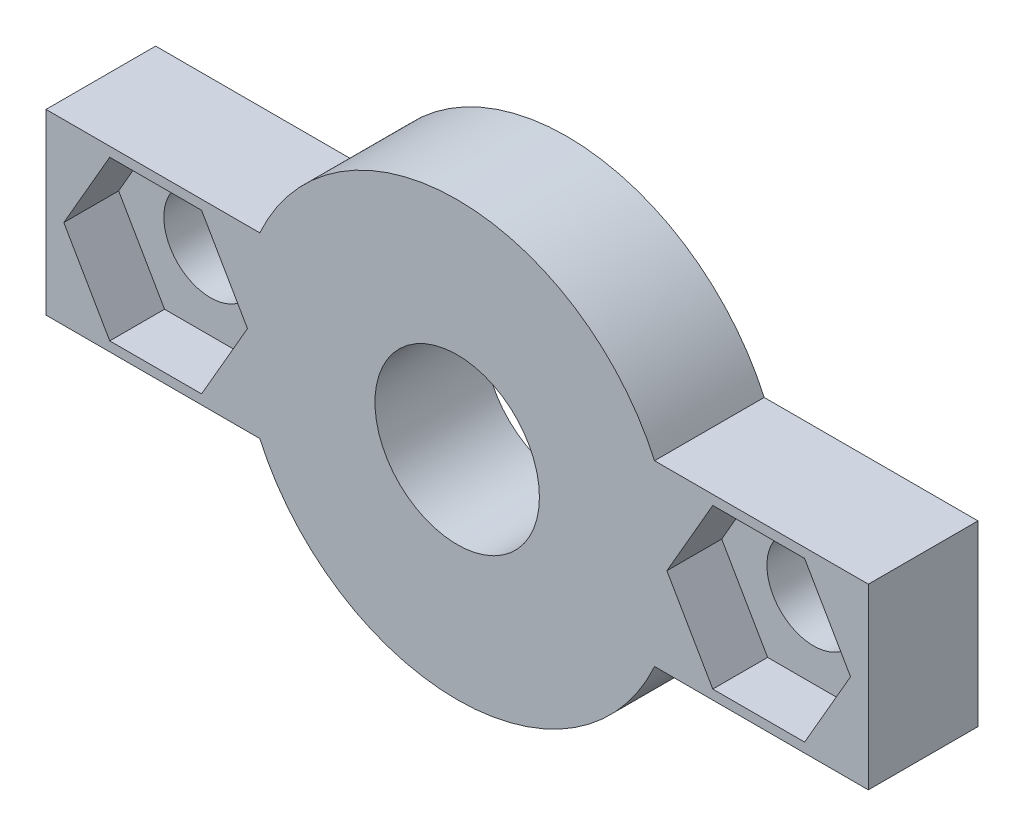
ISO-10303-21;
HEADER;
FILE_DESCRIPTION(('STEP AP214'),'2;1');
FILE_NAME('part.step','',(''),(''),'','','');
FILE_SCHEMA(('AUTOMOTIVE_DESIGN { 1 0 10303 214 1 1 1 1 }'));
ENDSEC;
DATA;
#1=APPLICATION_CONTEXT('core data for automotive mechanical design processes');
#2=APPLICATION_PROTOCOL_DEFINITION('international standard','automotive_design',2000,#1);
#3=PRODUCT_CONTEXT('',#1,'mechanical');
#4=PRODUCT('Part','Part','',(#3));
#5=PRODUCT_RELATED_PRODUCT_CATEGORY('part','',(#4));
#6=PRODUCT_DEFINITION_FORMATION('','',#4);
#7=PRODUCT_DEFINITION_CONTEXT('part definition',#1,'design');
#8=PRODUCT_DEFINITION('design','',#6,#7);
#9=PRODUCT_DEFINITION_SHAPE('','',#8);
#10=(LENGTH_UNIT() NAMED_UNIT(*) SI_UNIT(.MILLI.,.METRE.));
#11=(NAMED_UNIT(*) PLANE_ANGLE_UNIT() SI_UNIT($,.RADIAN.));
#12=(NAMED_UNIT(*) SI_UNIT($,.STERADIAN.) SOLID_ANGLE_UNIT());
#13=UNCERTAINTY_MEASURE_WITH_UNIT(LENGTH_MEASURE(1.E-05),#10,'distance_accuracy_value','');
#14=(GEOMETRIC_REPRESENTATION_CONTEXT(3) GLOBAL_UNCERTAINTY_ASSIGNED_CONTEXT((#13)) GLOBAL_UNIT_ASSIGNED_CONTEXT((#10,
#11,#12)) REPRESENTATION_CONTEXT('',''));
#15=CARTESIAN_POINT('',(0.,0.,0.));
#16=DIRECTION('',(0.,0.,1.));
#17=DIRECTION('',(1.,0.,0.));
#18=AXIS2_PLACEMENT_3D('',#15,#16,#17);
#19=CARTESIAN_POINT('',(0.,0.,4.));
#20=DIRECTION('',(0.,0.,1.));
#21=DIRECTION('',(1.,0.,0.));
#22=AXIS2_PLACEMENT_3D('',#19,#20,#21);
#23=PLANE('',#22);
#24=DIRECTION('',(-0.5,-0.866025403784439,0.));
#25=VECTOR('',#24,1.);
#26=CARTESIAN_POINT('',(-12.675,2.90118510267787,4.));
#27=LINE('',#26,#25);
#28=CARTESIAN_POINT('',(-12.675,2.90118510267787,4.));
#29=VERTEX_POINT('',#28);
#30=CARTESIAN_POINT('',(-14.35,0.,4.));
#31=VERTEX_POINT('',#30);
#32=EDGE_CURVE('E57',#29,#31,#27,.T.);
#33=ORIENTED_EDGE('',*,*,#32,.F.);
#34=DIRECTION('',(-1.,0.,0.));
#35=VECTOR('',#34,1.);
#36=CARTESIAN_POINT('',(-9.325,2.90118510267787,4.));
#37=LINE('',#36,#35);
#38=CARTESIAN_POINT('',(-9.325,2.90118510267787,4.));
#39=VERTEX_POINT('',#38);
#40=EDGE_CURVE('E203',#39,#29,#37,.T.);
#41=ORIENTED_EDGE('',*,*,#40,.F.);
#42=DIRECTION('',(-0.5,0.866025403784439,0.));
#43=VECTOR('',#42,1.);
#44=CARTESIAN_POINT('',(-7.65,0.,4.));
#45=LINE('',#44,#43);
#46=CARTESIAN_POINT('',(-7.65,0.,4.));
#47=VERTEX_POINT('',#46);
#48=EDGE_CURVE('E207',#47,#39,#45,.T.);
#49=ORIENTED_EDGE('',*,*,#48,.F.);
#50=DIRECTION('',(0.5,0.866025403784439,0.));
#51=VECTOR('',#50,1.);
#52=CARTESIAN_POINT('',(-9.325,-2.90118510267787,4.));
#53=LINE('',#52,#51);
#54=CARTESIAN_POINT('',(-9.325,-2.90118510267787,4.));
#55=VERTEX_POINT('',#54);
#56=EDGE_CURVE('E234',#55,#47,#53,.T.);
#57=ORIENTED_EDGE('',*,*,#56,.F.);
#58=DIRECTION('',(1.,0.,0.));
#59=VECTOR('',#58,1.);
#60=CARTESIAN_POINT('',(-12.675,-2.90118510267787,4.));
#61=LINE('',#60,#59);
#62=CARTESIAN_POINT('',(-12.675,-2.90118510267787,4.));
#63=VERTEX_POINT('',#62);
#64=EDGE_CURVE('E230',#63,#55,#61,.T.);
#65=ORIENTED_EDGE('',*,*,#64,.F.);
#66=DIRECTION('',(0.5,-0.866025403784438,0.));
#67=VECTOR('',#66,1.);
#68=CARTESIAN_POINT('',(-14.35,0.,4.));
#69=LINE('',#68,#67);
#70=EDGE_CURVE('E226',#31,#63,#69,.T.);
#71=ORIENTED_EDGE('',*,*,#70,.F.);
#72=EDGE_LOOP('',(#33,#41,#49,#57,#65,#71));
#73=FACE_BOUND('',#72,.T.);
#74=DIRECTION('',(0.5,0.866025403784439,0.));
#75=VECTOR('',#74,1.);
#76=CARTESIAN_POINT('',(12.675,-2.90118510267787,4.));
#77=LINE('',#76,#75);
#78=CARTESIAN_POINT('',(12.675,-2.90118510267787,4.));
#79=VERTEX_POINT('',#78);
#80=CARTESIAN_POINT('',(14.35,0.,4.));
#81=VERTEX_POINT('',#80);
#82=EDGE_CURVE('E65',#79,#81,#77,.T.);
#83=ORIENTED_EDGE('',*,*,#82,.F.);
#84=DIRECTION('',(1.,0.,0.));
#85=VECTOR('',#84,1.);
#86=CARTESIAN_POINT('',(9.325,-2.90118510267787,4.));
#87=LINE('',#86,#85);
#88=CARTESIAN_POINT('',(9.325,-2.90118510267787,4.));
#89=VERTEX_POINT('',#88);
#90=EDGE_CURVE('E261',#89,#79,#87,.T.);
#91=ORIENTED_EDGE('',*,*,#90,.F.);
#92=DIRECTION('',(0.5,-0.866025403784439,0.));
#93=VECTOR('',#92,1.);
#94=CARTESIAN_POINT('',(7.65,0.,4.));
#95=LINE('',#94,#93);
#96=CARTESIAN_POINT('',(7.65,0.,4.));
#97=VERTEX_POINT('',#96);
#98=EDGE_CURVE('E296',#97,#89,#95,.T.);
#99=ORIENTED_EDGE('',*,*,#98,.F.);
#100=DIRECTION('',(-0.5,-0.866025403784439,0.));
#101=VECTOR('',#100,1.);
#102=CARTESIAN_POINT('',(9.325,2.90118510267787,4.));
#103=LINE('',#102,#101);
#104=CARTESIAN_POINT('',(9.325,2.90118510267787,4.));
#105=VERTEX_POINT('',#104);
#106=EDGE_CURVE('E292',#105,#97,#103,.T.);
#107=ORIENTED_EDGE('',*,*,#106,.F.);
#108=DIRECTION('',(-1.,0.,0.));
#109=VECTOR('',#108,1.);
#110=CARTESIAN_POINT('',(12.675,2.90118510267787,4.));
#111=LINE('',#110,#109);
#112=CARTESIAN_POINT('',(12.675,2.90118510267787,4.));
#113=VERTEX_POINT('',#112);
#114=EDGE_CURVE('E288',#113,#105,#111,.T.);
#115=ORIENTED_EDGE('',*,*,#114,.F.);
#116=DIRECTION('',(-0.5,0.866025403784439,0.));
#117=VECTOR('',#116,1.);
#118=CARTESIAN_POINT('',(14.35,0.,4.));
#119=LINE('',#118,#117);
#120=EDGE_CURVE('E284',#81,#113,#119,.T.);
#121=ORIENTED_EDGE('',*,*,#120,.F.);
#122=EDGE_LOOP('',(#83,#91,#99,#107,#115,#121));
#123=FACE_BOUND('',#122,.T.);
#124=DIRECTION('',(0.,-1.,0.));
#125=VECTOR('',#124,1.);
#126=CARTESIAN_POINT('',(-15.,-3.25,4.));
#127=LINE('',#126,#125);
#128=CARTESIAN_POINT('',(-15.,3.25,4.));
#129=VERTEX_POINT('',#128);
#130=CARTESIAN_POINT('',(-15.,-3.25,4.));
#131=VERTEX_POINT('',#130);
#132=EDGE_CURVE('E327',#129,#131,#127,.T.);
#133=ORIENTED_EDGE('',*,*,#132,.T.);
#134=DIRECTION('',(1.,0.,0.));
#135=VECTOR('',#134,1.);
#136=CARTESIAN_POINT('',(-7.20052081449669,-3.25,4.));
#137=LINE('',#136,#135);
#138=CARTESIAN_POINT('',(-7.20052081449669,-3.25,4.));
#139=VERTEX_POINT('',#138);
#140=EDGE_CURVE('E331',#131,#139,#137,.T.);
#141=ORIENTED_EDGE('',*,*,#140,.T.);
#142=CARTESIAN_POINT('',(0.,0.,4.));
#143=DIRECTION('',(0.,0.,1.));
#144=DIRECTION('',(1.,0.,0.));
#145=AXIS2_PLACEMENT_3D('',#142,#143,#144);
#146=CIRCLE('',#145,7.9);
#147=CARTESIAN_POINT('',(7.20052081449669,-3.25,4.));
#148=VERTEX_POINT('',#147);
#149=EDGE_CURVE('E335',#139,#148,#146,.T.);
#150=ORIENTED_EDGE('',*,*,#149,.T.);
#151=DIRECTION('',(1.,0.,0.));
#152=VECTOR('',#151,1.);
#153=CARTESIAN_POINT('',(15.,-3.25,4.));
#154=LINE('',#153,#152);
#155=CARTESIAN_POINT('',(15.,-3.25,4.));
#156=VERTEX_POINT('',#155);
#157=EDGE_CURVE('E338',#148,#156,#154,.T.);
#158=ORIENTED_EDGE('',*,*,#157,.T.);
#159=DIRECTION('',(0.,1.,0.));
#160=VECTOR('',#159,1.);
#161=CARTESIAN_POINT('',(15.,-3.25,4.));
#162=LINE('',#161,#160);
#163=CARTESIAN_POINT('',(15.,3.25,4.));
#164=VERTEX_POINT('',#163);
#165=EDGE_CURVE('E341',#156,#164,#162,.T.);
#166=ORIENTED_EDGE('',*,*,#165,.T.);
#167=DIRECTION('',(-1.,0.,0.));
#168=VECTOR('',#167,1.);
#169=CARTESIAN_POINT('',(15.,3.25,4.));
#170=LINE('',#169,#168);
#171=CARTESIAN_POINT('',(7.20052081449669,3.25,4.));
#172=VERTEX_POINT('',#171);
#173=EDGE_CURVE('E344',#164,#172,#170,.T.);
#174=ORIENTED_EDGE('',*,*,#173,.T.);
#175=CARTESIAN_POINT('',(0.,0.,4.));
#176=DIRECTION('',(0.,0.,1.));
#177=DIRECTION('',(1.,0.,0.));
#178=AXIS2_PLACEMENT_3D('',#175,#176,#177);
#179=CIRCLE('',#178,7.9);
#180=CARTESIAN_POINT('',(-7.20052081449669,3.25,4.));
#181=VERTEX_POINT('',#180);
#182=EDGE_CURVE('E347',#172,#181,#179,.T.);
#183=ORIENTED_EDGE('',*,*,#182,.T.);
#184=DIRECTION('',(-1.,0.,0.));
#185=VECTOR('',#184,1.);
#186=CARTESIAN_POINT('',(-7.20052081449669,3.25,4.));
#187=LINE('',#186,#185);
#188=EDGE_CURVE('E350',#181,#129,#187,.T.);
#189=ORIENTED_EDGE('',*,*,#188,.T.);
#190=EDGE_LOOP('',(#133,#141,#150,#158,#166,#174,#183,#189));
#191=FACE_BOUND('',#190,.T.);
#192=CARTESIAN_POINT('',(0.,0.,4.));
#193=DIRECTION('',(0.,0.,1.));
#194=DIRECTION('',(1.,0.,0.));
#195=AXIS2_PLACEMENT_3D('',#192,#193,#194);
#196=CIRCLE('',#195,3.);
#197=CARTESIAN_POINT('',(3.,0.,4.));
#198=VERTEX_POINT('',#197);
#199=EDGE_CURVE('E319',#198,#198,#196,.T.);
#200=ORIENTED_EDGE('',*,*,#199,.F.);
#201=EDGE_LOOP('',(#200));
#202=FACE_BOUND('',#201,.T.);
#203=ADVANCED_FACE('F39',(#73,#123,#191,#202),#23,.T.);
#204=CARTESIAN_POINT('',(0.,0.,0.));
#205=DIRECTION('',(0.,0.,1.));
#206=DIRECTION('',(1.,0.,0.));
#207=AXIS2_PLACEMENT_3D('',#204,#205,#206);
#208=PLANE('',#207);
#209=CARTESIAN_POINT('',(-11.,0.,0.));
#210=DIRECTION('',(0.,0.,1.));
#211=DIRECTION('',(1.,0.,0.));
#212=AXIS2_PLACEMENT_3D('',#209,#210,#211);
#213=CIRCLE('',#212,1.7);
#214=CARTESIAN_POINT('',(-9.3,0.,0.));
#215=VERTEX_POINT('',#214);
#216=EDGE_CURVE('E405',#215,#215,#213,.T.);
#217=ORIENTED_EDGE('',*,*,#216,.T.);
#218=EDGE_LOOP('',(#217));
#219=FACE_BOUND('',#218,.T.);
#220=CARTESIAN_POINT('',(11.,0.,0.));
#221=DIRECTION('',(0.,0.,1.));
#222=DIRECTION('',(1.,0.,0.));
#223=AXIS2_PLACEMENT_3D('',#220,#221,#222);
#224=CIRCLE('',#223,1.7);
#225=CARTESIAN_POINT('',(12.7,0.,0.));
#226=VERTEX_POINT('',#225);
#227=EDGE_CURVE('E210',#226,#226,#224,.T.);
#228=ORIENTED_EDGE('',*,*,#227,.T.);
#229=EDGE_LOOP('',(#228));
#230=FACE_BOUND('',#229,.T.);
#231=DIRECTION('',(0.,-1.,0.));
#232=VECTOR('',#231,1.);
#233=CARTESIAN_POINT('',(-15.,-3.25,0.));
#234=LINE('',#233,#232);
#235=CARTESIAN_POINT('',(-15.,3.25,0.));
#236=VERTEX_POINT('',#235);
#237=CARTESIAN_POINT('',(-15.,-3.25,0.));
#238=VERTEX_POINT('',#237);
#239=EDGE_CURVE('E323',#236,#238,#234,.T.);
#240=ORIENTED_EDGE('',*,*,#239,.F.);
#241=DIRECTION('',(-1.,0.,0.));
#242=VECTOR('',#241,1.);
#243=CARTESIAN_POINT('',(-7.20052081449669,3.25,0.));
#244=LINE('',#243,#242);
#245=CARTESIAN_POINT('',(-7.20052081449669,3.25,0.));
#246=VERTEX_POINT('',#245);
#247=EDGE_CURVE('E332',#246,#236,#244,.T.);
#248=ORIENTED_EDGE('',*,*,#247,.F.);
#249=CARTESIAN_POINT('',(0.,0.,0.));
#250=DIRECTION('',(0.,0.,1.));
#251=DIRECTION('',(1.,0.,0.));
#252=AXIS2_PLACEMENT_3D('',#249,#250,#251);
#253=CIRCLE('',#252,7.9);
#254=CARTESIAN_POINT('',(7.20052081449669,3.25,0.));
#255=VERTEX_POINT('',#254);
#256=EDGE_CURVE('E372',#255,#246,#253,.T.);
#257=ORIENTED_EDGE('',*,*,#256,.F.);
#258=DIRECTION('',(-1.,0.,0.));
#259=VECTOR('',#258,1.);
#260=CARTESIAN_POINT('',(15.,3.25,0.));
#261=LINE('',#260,#259);
#262=CARTESIAN_POINT('',(15.,3.25,0.));
#263=VERTEX_POINT('',#262);
#264=EDGE_CURVE('E369',#263,#255,#261,.T.);
#265=ORIENTED_EDGE('',*,*,#264,.F.);
#266=DIRECTION('',(0.,1.,0.));
#267=VECTOR('',#266,1.);
#268=CARTESIAN_POINT('',(15.,-3.25,0.));
#269=LINE('',#268,#267);
#270=CARTESIAN_POINT('',(15.,-3.25,0.));
#271=VERTEX_POINT('',#270);
#272=EDGE_CURVE('E366',#271,#263,#269,.T.);
#273=ORIENTED_EDGE('',*,*,#272,.F.);
#274=DIRECTION('',(1.,0.,0.));
#275=VECTOR('',#274,1.);
#276=CARTESIAN_POINT('',(15.,-3.25,0.));
#277=LINE('',#276,#275);
#278=CARTESIAN_POINT('',(7.20052081449669,-3.25,0.));
#279=VERTEX_POINT('',#278);
#280=EDGE_CURVE('E363',#279,#271,#277,.T.);
#281=ORIENTED_EDGE('',*,*,#280,.F.);
#282=CARTESIAN_POINT('',(0.,0.,0.));
#283=DIRECTION('',(0.,0.,1.));
#284=DIRECTION('',(1.,0.,0.));
#285=AXIS2_PLACEMENT_3D('',#282,#283,#284);
#286=CIRCLE('',#285,7.9);
#287=CARTESIAN_POINT('',(-7.20052081449669,-3.25,0.));
#288=VERTEX_POINT('',#287);
#289=EDGE_CURVE('E360',#288,#279,#286,.T.);
#290=ORIENTED_EDGE('',*,*,#289,.F.);
#291=DIRECTION('',(1.,0.,0.));
#292=VECTOR('',#291,1.);
#293=CARTESIAN_POINT('',(-7.20052081449669,-3.25,0.));
#294=LINE('',#293,#292);
#295=EDGE_CURVE('E357',#238,#288,#294,.T.);
#296=ORIENTED_EDGE('',*,*,#295,.F.);
#297=EDGE_LOOP('',(#240,#248,#257,#265,#273,#281,#290,#296));
#298=FACE_BOUND('',#297,.T.);
#299=CARTESIAN_POINT('',(0.,0.,0.));
#300=DIRECTION('',(0.,0.,1.));
#301=DIRECTION('',(1.,0.,0.));
#302=AXIS2_PLACEMENT_3D('',#299,#300,#301);
#303=CIRCLE('',#302,3.);
#304=CARTESIAN_POINT('',(3.,0.,0.));
#305=VERTEX_POINT('',#304);
#306=EDGE_CURVE('E244',#305,#305,#303,.T.);
#307=ORIENTED_EDGE('',*,*,#306,.T.);
#308=EDGE_LOOP('',(#307));
#309=FACE_BOUND('',#308,.T.);
#310=ADVANCED_FACE('F420',(#219,#230,#298,#309),#208,.F.);
#311=CARTESIAN_POINT('',(-15.,-3.25,4.));
#312=DIRECTION('',(1.,0.,0.));
#313=DIRECTION('',(0.,0.,-1.));
#314=AXIS2_PLACEMENT_3D('',#311,#312,#313);
#315=PLANE('',#314);
#316=ORIENTED_EDGE('',*,*,#239,.T.);
#317=DIRECTION('',(0.,0.,-1.));
#318=VECTOR('',#317,1.);
#319=CARTESIAN_POINT('',(-15.,-3.25,4.));
#320=LINE('',#319,#318);
#321=EDGE_CURVE('E11',#131,#238,#320,.T.);
#322=ORIENTED_EDGE('',*,*,#321,.F.);
#323=ORIENTED_EDGE('',*,*,#132,.F.);
#324=DIRECTION('',(0.,0.,-1.));
#325=VECTOR('',#324,1.);
#326=CARTESIAN_POINT('',(-15.,3.25,4.));
#327=LINE('',#326,#325);
#328=EDGE_CURVE('E353',#129,#236,#327,.T.);
#329=ORIENTED_EDGE('',*,*,#328,.T.);
#330=EDGE_LOOP('',(#316,#322,#323,#329));
#331=FACE_BOUND('',#330,.T.);
#332=ADVANCED_FACE('F41',(#331),#315,.F.);
#333=CARTESIAN_POINT('',(-7.20052081449669,-3.25,4.));
#334=DIRECTION('',(0.,1.,0.));
#335=DIRECTION('',(-1.,0.,0.));
#336=AXIS2_PLACEMENT_3D('',#333,#334,#335);
#337=PLANE('',#336);
#338=ORIENTED_EDGE('',*,*,#295,.T.);
#339=DIRECTION('',(0.,0.,-1.));
#340=VECTOR('',#339,1.);
#341=CARTESIAN_POINT('',(-7.20052081449669,-3.25,4.));
#342=LINE('',#341,#340);
#343=EDGE_CURVE('E49',#139,#288,#342,.T.);
#344=ORIENTED_EDGE('',*,*,#343,.F.);
#345=ORIENTED_EDGE('',*,*,#140,.F.);
#346=ORIENTED_EDGE('',*,*,#321,.T.);
#347=EDGE_LOOP('',(#338,#344,#345,#346));
#348=FACE_BOUND('',#347,.T.);
#349=ADVANCED_FACE('F466',(#348),#337,.F.);
#350=CARTESIAN_POINT('',(0.,0.,4.));
#351=DIRECTION('',(0.,0.,-1.));
#352=DIRECTION('',(-1.,0.,0.));
#353=AXIS2_PLACEMENT_3D('',#350,#351,#352);
#354=CYLINDRICAL_SURFACE('',#353,7.9);
#355=ORIENTED_EDGE('',*,*,#289,.T.);
#356=DIRECTION('',(0.,0.,-1.));
#357=VECTOR('',#356,1.);
#358=CARTESIAN_POINT('',(7.20052081449669,-3.25,4.));
#359=LINE('',#358,#357);
#360=EDGE_CURVE('E396',#148,#279,#359,.T.);
#361=ORIENTED_EDGE('',*,*,#360,.F.);
#362=ORIENTED_EDGE('',*,*,#149,.F.);
#363=ORIENTED_EDGE('',*,*,#343,.T.);
#364=EDGE_LOOP('',(#355,#361,#362,#363));
#365=FACE_BOUND('',#364,.T.);
#366=ADVANCED_FACE('F463',(#365),#354,.T.);
#367=CARTESIAN_POINT('',(15.,-3.25,4.));
#368=DIRECTION('',(0.,1.,0.));
#369=DIRECTION('',(-1.,0.,0.));
#370=AXIS2_PLACEMENT_3D('',#367,#368,#369);
#371=PLANE('',#370);
#372=ORIENTED_EDGE('',*,*,#280,.T.);
#373=DIRECTION('',(0.,0.,-1.));
#374=VECTOR('',#373,1.);
#375=CARTESIAN_POINT('',(15.,-3.25,4.));
#376=LINE('',#375,#374);
#377=EDGE_CURVE('E392',#156,#271,#376,.T.);
#378=ORIENTED_EDGE('',*,*,#377,.F.);
#379=ORIENTED_EDGE('',*,*,#157,.F.);
#380=ORIENTED_EDGE('',*,*,#360,.T.);
#381=EDGE_LOOP('',(#372,#378,#379,#380));
#382=FACE_BOUND('',#381,.T.);
#383=ADVANCED_FACE('F459',(#382),#371,.F.);
#384=CARTESIAN_POINT('',(15.,-3.25,4.));
#385=DIRECTION('',(-1.,0.,0.));
#386=DIRECTION('',(0.,-1.,0.));
#387=AXIS2_PLACEMENT_3D('',#384,#385,#386);
#388=PLANE('',#387);
#389=ORIENTED_EDGE('',*,*,#272,.T.);
#390=DIRECTION('',(0.,0.,-1.));
#391=VECTOR('',#390,1.);
#392=CARTESIAN_POINT('',(15.,3.25,4.));
#393=LINE('',#392,#391);
#394=EDGE_CURVE('E388',#164,#263,#393,.T.);
#395=ORIENTED_EDGE('',*,*,#394,.F.);
#396=ORIENTED_EDGE('',*,*,#165,.F.);
#397=ORIENTED_EDGE('',*,*,#377,.T.);
#398=EDGE_LOOP('',(#389,#395,#396,#397));
#399=FACE_BOUND('',#398,.T.);
#400=ADVANCED_FACE('F455',(#399),#388,.F.);
#401=CARTESIAN_POINT('',(15.,3.25,4.));
#402=DIRECTION('',(0.,-1.,0.));
#403=DIRECTION('',(1.,0.,0.));
#404=AXIS2_PLACEMENT_3D('',#401,#402,#403);
#405=PLANE('',#404);
#406=ORIENTED_EDGE('',*,*,#264,.T.);
#407=DIRECTION('',(0.,0.,-1.));
#408=VECTOR('',#407,1.);
#409=CARTESIAN_POINT('',(7.20052081449669,3.25,4.));
#410=LINE('',#409,#408);
#411=EDGE_CURVE('E384',#172,#255,#410,.T.);
#412=ORIENTED_EDGE('',*,*,#411,.F.);
#413=ORIENTED_EDGE('',*,*,#173,.F.);
#414=ORIENTED_EDGE('',*,*,#394,.T.);
#415=EDGE_LOOP('',(#406,#412,#413,#414));
#416=FACE_BOUND('',#415,.T.);
#417=ADVANCED_FACE('F451',(#416),#405,.F.);
#418=CARTESIAN_POINT('',(0.,0.,4.));
#419=DIRECTION('',(0.,0.,-1.));
#420=DIRECTION('',(-1.,0.,0.));
#421=AXIS2_PLACEMENT_3D('',#418,#419,#420);
#422=CYLINDRICAL_SURFACE('',#421,7.9);
#423=ORIENTED_EDGE('',*,*,#256,.T.);
#424=DIRECTION('',(0.,0.,-1.));
#425=VECTOR('',#424,1.);
#426=CARTESIAN_POINT('',(-7.20052081449669,3.25,4.));
#427=LINE('',#426,#425);
#428=EDGE_CURVE('E380',#181,#246,#427,.T.);
#429=ORIENTED_EDGE('',*,*,#428,.F.);
#430=ORIENTED_EDGE('',*,*,#182,.F.);
#431=ORIENTED_EDGE('',*,*,#411,.T.);
#432=EDGE_LOOP('',(#423,#429,#430,#431));
#433=FACE_BOUND('',#432,.T.);
#434=ADVANCED_FACE('F447',(#433),#422,.T.);
#435=CARTESIAN_POINT('',(-7.20052081449669,3.25,4.));
#436=DIRECTION('',(0.,-1.,0.));
#437=DIRECTION('',(1.,0.,0.));
#438=AXIS2_PLACEMENT_3D('',#435,#436,#437);
#439=PLANE('',#438);
#440=ORIENTED_EDGE('',*,*,#247,.T.);
#441=ORIENTED_EDGE('',*,*,#328,.F.);
#442=ORIENTED_EDGE('',*,*,#188,.F.);
#443=ORIENTED_EDGE('',*,*,#428,.T.);
#444=EDGE_LOOP('',(#440,#441,#442,#443));
#445=FACE_BOUND('',#444,.T.);
#446=ADVANCED_FACE('F444',(#445),#439,.F.);
#447=CARTESIAN_POINT('',(0.,0.,4.));
#448=DIRECTION('',(0.,0.,-1.));
#449=DIRECTION('',(-1.,0.,0.));
#450=AXIS2_PLACEMENT_3D('',#447,#448,#449);
#451=CYLINDRICAL_SURFACE('',#450,3.);
#452=ORIENTED_EDGE('',*,*,#199,.T.);
#453=EDGE_LOOP('',(#452));
#454=FACE_BOUND('',#453,.T.);
#455=ORIENTED_EDGE('',*,*,#306,.F.);
#456=EDGE_LOOP('',(#455));
#457=FACE_BOUND('',#456,.T.);
#458=ADVANCED_FACE('F441',(#454,#457),#451,.F.);
#459=CARTESIAN_POINT('',(12.675,-2.90118510267787,2.));
#460=DIRECTION('',(0.866025403784439,-0.5,0.));
#461=DIRECTION('',(0.5,0.866025403784439,0.));
#462=AXIS2_PLACEMENT_3D('',#459,#460,#461);
#463=PLANE('',#462);
#464=ORIENTED_EDGE('',*,*,#82,.T.);
#465=DIRECTION('',(0.,0.,1.));
#466=VECTOR('',#465,1.);
#467=CARTESIAN_POINT('',(14.35,0.,2.));
#468=LINE('',#467,#466);
#469=CARTESIAN_POINT('',(14.35,0.,2.));
#470=VERTEX_POINT('',#469);
#471=EDGE_CURVE('E281',#470,#81,#468,.T.);
#472=ORIENTED_EDGE('',*,*,#471,.F.);
#473=DIRECTION('',(0.5,0.866025403784439,0.));
#474=VECTOR('',#473,1.);
#475=CARTESIAN_POINT('',(12.675,-2.90118510267787,2.));
#476=LINE('',#475,#474);
#477=CARTESIAN_POINT('',(12.675,-2.90118510267787,2.));
#478=VERTEX_POINT('',#477);
#479=EDGE_CURVE('E256',#478,#470,#476,.T.);
#480=ORIENTED_EDGE('',*,*,#479,.F.);
#481=DIRECTION('',(0.,0.,1.));
#482=VECTOR('',#481,1.);
#483=CARTESIAN_POINT('',(12.675,-2.90118510267787,2.));
#484=LINE('',#483,#482);
#485=EDGE_CURVE('E227',#478,#79,#484,.T.);
#486=ORIENTED_EDGE('',*,*,#485,.T.);
#487=EDGE_LOOP('',(#464,#472,#480,#486));
#488=FACE_BOUND('',#487,.T.);
#489=ADVANCED_FACE('F503',(#488),#463,.F.);
#490=CARTESIAN_POINT('',(9.325,-2.90118510267787,2.));
#491=DIRECTION('',(0.,-1.,0.));
#492=DIRECTION('',(0.,0.,-1.));
#493=AXIS2_PLACEMENT_3D('',#490,#491,#492);
#494=PLANE('',#493);
#495=ORIENTED_EDGE('',*,*,#90,.T.);
#496=ORIENTED_EDGE('',*,*,#485,.F.);
#497=DIRECTION('',(1.,0.,0.));
#498=VECTOR('',#497,1.);
#499=CARTESIAN_POINT('',(9.325,-2.90118510267787,2.));
#500=LINE('',#499,#498);
#501=CARTESIAN_POINT('',(9.325,-2.90118510267787,2.));
#502=VERTEX_POINT('',#501);
#503=EDGE_CURVE('E277',#502,#478,#500,.T.);
#504=ORIENTED_EDGE('',*,*,#503,.F.);
#505=DIRECTION('',(0.,0.,1.));
#506=VECTOR('',#505,1.);
#507=CARTESIAN_POINT('',(9.325,-2.90118510267787,2.));
#508=LINE('',#507,#506);
#509=EDGE_CURVE('E305',#502,#89,#508,.T.);
#510=ORIENTED_EDGE('',*,*,#509,.T.);
#511=EDGE_LOOP('',(#495,#496,#504,#510));
#512=FACE_BOUND('',#511,.T.);
#513=ADVANCED_FACE('F508',(#512),#494,.F.);
#514=CARTESIAN_POINT('',(7.65,0.,2.));
#515=DIRECTION('',(-0.866025403784439,-0.499999999999999,0.));
#516=DIRECTION('',(0.499999999999999,-0.866025403784439,0.));
#517=AXIS2_PLACEMENT_3D('',#514,#515,#516);
#518=PLANE('',#517);
#519=ORIENTED_EDGE('',*,*,#98,.T.);
#520=ORIENTED_EDGE('',*,*,#509,.F.);
#521=DIRECTION('',(0.5,-0.866025403784439,0.));
#522=VECTOR('',#521,1.);
#523=CARTESIAN_POINT('',(7.65,0.,2.));
#524=LINE('',#523,#522);
#525=CARTESIAN_POINT('',(7.65,0.,2.));
#526=VERTEX_POINT('',#525);
#527=EDGE_CURVE('E273',#526,#502,#524,.T.);
#528=ORIENTED_EDGE('',*,*,#527,.F.);
#529=DIRECTION('',(0.,0.,1.));
#530=VECTOR('',#529,1.);
#531=CARTESIAN_POINT('',(7.65,0.,2.));
#532=LINE('',#531,#530);
#533=EDGE_CURVE('E308',#526,#97,#532,.T.);
#534=ORIENTED_EDGE('',*,*,#533,.T.);
#535=EDGE_LOOP('',(#519,#520,#528,#534));
#536=FACE_BOUND('',#535,.T.);
#537=ADVANCED_FACE('F512',(#536),#518,.F.);
#538=CARTESIAN_POINT('',(9.325,2.90118510267787,2.));
#539=DIRECTION('',(-0.866025403784439,0.5,0.));
#540=DIRECTION('',(-0.5,-0.866025403784439,0.));
#541=AXIS2_PLACEMENT_3D('',#538,#539,#540);
#542=PLANE('',#541);
#543=ORIENTED_EDGE('',*,*,#106,.T.);
#544=ORIENTED_EDGE('',*,*,#533,.F.);
#545=DIRECTION('',(-0.5,-0.866025403784439,0.));
#546=VECTOR('',#545,1.);
#547=CARTESIAN_POINT('',(9.325,2.90118510267787,2.));
#548=LINE('',#547,#546);
#549=CARTESIAN_POINT('',(9.325,2.90118510267787,2.));
#550=VERTEX_POINT('',#549);
#551=EDGE_CURVE('E269',#550,#526,#548,.T.);
#552=ORIENTED_EDGE('',*,*,#551,.F.);
#553=DIRECTION('',(0.,0.,1.));
#554=VECTOR('',#553,1.);
#555=CARTESIAN_POINT('',(9.325,2.90118510267787,2.));
#556=LINE('',#555,#554);
#557=EDGE_CURVE('E311',#550,#105,#556,.T.);
#558=ORIENTED_EDGE('',*,*,#557,.T.);
#559=EDGE_LOOP('',(#543,#544,#552,#558));
#560=FACE_BOUND('',#559,.T.);
#561=ADVANCED_FACE('F524',(#560),#542,.F.);
#562=CARTESIAN_POINT('',(12.675,2.90118510267787,2.));
#563=DIRECTION('',(0.,1.,0.));
#564=DIRECTION('',(-1.,0.,0.));
#565=AXIS2_PLACEMENT_3D('',#562,#563,#564);
#566=PLANE('',#565);
#567=ORIENTED_EDGE('',*,*,#114,.T.);
#568=ORIENTED_EDGE('',*,*,#557,.F.);
#569=DIRECTION('',(-1.,0.,0.));
#570=VECTOR('',#569,1.);
#571=CARTESIAN_POINT('',(12.675,2.90118510267787,2.));
#572=LINE('',#571,#570);
#573=CARTESIAN_POINT('',(12.675,2.90118510267787,2.));
#574=VERTEX_POINT('',#573);
#575=EDGE_CURVE('E265',#574,#550,#572,.T.);
#576=ORIENTED_EDGE('',*,*,#575,.F.);
#577=DIRECTION('',(0.,0.,1.));
#578=VECTOR('',#577,1.);
#579=CARTESIAN_POINT('',(12.675,2.90118510267787,2.));
#580=LINE('',#579,#578);
#581=EDGE_CURVE('E314',#574,#113,#580,.T.);
#582=ORIENTED_EDGE('',*,*,#581,.T.);
#583=EDGE_LOOP('',(#567,#568,#576,#582));
#584=FACE_BOUND('',#583,.T.);
#585=ADVANCED_FACE('F520',(#584),#566,.F.);
#586=CARTESIAN_POINT('',(14.35,0.,2.));
#587=DIRECTION('',(0.866025403784439,0.5,0.));
#588=DIRECTION('',(-0.5,0.866025403784439,0.));
#589=AXIS2_PLACEMENT_3D('',#586,#587,#588);
#590=PLANE('',#589);
#591=ORIENTED_EDGE('',*,*,#120,.T.);
#592=ORIENTED_EDGE('',*,*,#581,.F.);
#593=DIRECTION('',(-0.5,0.866025403784439,0.));
#594=VECTOR('',#593,1.);
#595=CARTESIAN_POINT('',(14.35,0.,2.));
#596=LINE('',#595,#594);
#597=EDGE_CURVE('E260',#470,#574,#596,.T.);
#598=ORIENTED_EDGE('',*,*,#597,.F.);
#599=ORIENTED_EDGE('',*,*,#471,.T.);
#600=EDGE_LOOP('',(#591,#592,#598,#599));
#601=FACE_BOUND('',#600,.T.);
#602=ADVANCED_FACE('F516',(#601),#590,.F.);
#603=CARTESIAN_POINT('',(0.,0.,2.));
#604=DIRECTION('',(0.,0.,1.));
#605=DIRECTION('',(1.,0.,0.));
#606=AXIS2_PLACEMENT_3D('',#603,#604,#605);
#607=PLANE('',#606);
#608=CARTESIAN_POINT('',(11.,0.,2.));
#609=DIRECTION('',(0.,0.,1.));
#610=DIRECTION('',(1.,0.,0.));
#611=AXIS2_PLACEMENT_3D('',#608,#609,#610);
#612=CIRCLE('',#611,1.7);
#613=CARTESIAN_POINT('',(12.7,0.,2.));
#614=VERTEX_POINT('',#613);
#615=EDGE_CURVE('E43',#614,#614,#612,.T.);
#616=ORIENTED_EDGE('',*,*,#615,.F.);
#617=EDGE_LOOP('',(#616));
#618=FACE_BOUND('',#617,.T.);
#619=ORIENTED_EDGE('',*,*,#479,.T.);
#620=ORIENTED_EDGE('',*,*,#597,.T.);
#621=ORIENTED_EDGE('',*,*,#575,.T.);
#622=ORIENTED_EDGE('',*,*,#551,.T.);
#623=ORIENTED_EDGE('',*,*,#527,.T.);
#624=ORIENTED_EDGE('',*,*,#503,.T.);
#625=EDGE_LOOP('',(#619,#620,#621,#622,#623,#624));
#626=FACE_BOUND('',#625,.T.);
#627=ADVANCED_FACE('F519',(#618,#626),#607,.T.);
#628=CARTESIAN_POINT('',(-12.675,2.90118510267787,2.));
#629=DIRECTION('',(-0.866025403784439,0.5,0.));
#630=DIRECTION('',(-0.5,-0.866025403784439,0.));
#631=AXIS2_PLACEMENT_3D('',#628,#629,#630);
#632=PLANE('',#631);
#633=ORIENTED_EDGE('',*,*,#32,.T.);
#634=DIRECTION('',(0.,0.,1.));
#635=VECTOR('',#634,1.);
#636=CARTESIAN_POINT('',(-14.35,0.,2.));
#637=LINE('',#636,#635);
#638=CARTESIAN_POINT('',(-14.35,0.,2.));
#639=VERTEX_POINT('',#638);
#640=EDGE_CURVE('E177',#639,#31,#637,.T.);
#641=ORIENTED_EDGE('',*,*,#640,.F.);
#642=DIRECTION('',(-0.5,-0.866025403784439,0.));
#643=VECTOR('',#642,1.);
#644=CARTESIAN_POINT('',(-12.675,2.90118510267787,2.));
#645=LINE('',#644,#643);
#646=CARTESIAN_POINT('',(-12.675,2.90118510267787,2.));
#647=VERTEX_POINT('',#646);
#648=EDGE_CURVE('E181',#647,#639,#645,.T.);
#649=ORIENTED_EDGE('',*,*,#648,.F.);
#650=DIRECTION('',(0.,0.,1.));
#651=VECTOR('',#650,1.);
#652=CARTESIAN_POINT('',(-12.675,2.90118510267787,2.));
#653=LINE('',#652,#651);
#654=EDGE_CURVE('E241',#647,#29,#653,.T.);
#655=ORIENTED_EDGE('',*,*,#654,.T.);
#656=EDGE_LOOP('',(#633,#641,#649,#655));
#657=FACE_BOUND('',#656,.T.);
#658=ADVANCED_FACE('F179',(#657),#632,.F.);
#659=CARTESIAN_POINT('',(-9.325,2.90118510267787,2.));
#660=DIRECTION('',(0.,1.,0.));
#661=DIRECTION('',(0.,0.,1.));
#662=AXIS2_PLACEMENT_3D('',#659,#660,#661);
#663=PLANE('',#662);
#664=ORIENTED_EDGE('',*,*,#40,.T.);
#665=ORIENTED_EDGE('',*,*,#654,.F.);
#666=DIRECTION('',(-1.,0.,0.));
#667=VECTOR('',#666,1.);
#668=CARTESIAN_POINT('',(-9.325,2.90118510267787,2.));
#669=LINE('',#668,#667);
#670=CARTESIAN_POINT('',(-9.325,2.90118510267787,2.));
#671=VERTEX_POINT('',#670);
#672=EDGE_CURVE('E188',#671,#647,#669,.T.);
#673=ORIENTED_EDGE('',*,*,#672,.F.);
#674=DIRECTION('',(0.,0.,1.));
#675=VECTOR('',#674,1.);
#676=CARTESIAN_POINT('',(-9.325,2.90118510267787,2.));
#677=LINE('',#676,#675);
#678=EDGE_CURVE('E245',#671,#39,#677,.T.);
#679=ORIENTED_EDGE('',*,*,#678,.T.);
#680=EDGE_LOOP('',(#664,#665,#673,#679));
#681=FACE_BOUND('',#680,.T.);
#682=ADVANCED_FACE('F537',(#681),#663,.F.);
#683=CARTESIAN_POINT('',(-7.65,0.,2.));
#684=DIRECTION('',(0.866025403784439,0.5,0.));
#685=DIRECTION('',(-0.5,0.866025403784439,0.));
#686=AXIS2_PLACEMENT_3D('',#683,#684,#685);
#687=PLANE('',#686);
#688=ORIENTED_EDGE('',*,*,#48,.T.);
#689=ORIENTED_EDGE('',*,*,#678,.F.);
#690=DIRECTION('',(-0.5,0.866025403784439,0.));
#691=VECTOR('',#690,1.);
#692=CARTESIAN_POINT('',(-7.65,0.,2.));
#693=LINE('',#692,#691);
#694=CARTESIAN_POINT('',(-7.65,0.,2.));
#695=VERTEX_POINT('',#694);
#696=EDGE_CURVE('E219',#695,#671,#693,.T.);
#697=ORIENTED_EDGE('',*,*,#696,.F.);
#698=DIRECTION('',(0.,0.,1.));
#699=VECTOR('',#698,1.);
#700=CARTESIAN_POINT('',(-7.65,0.,2.));
#701=LINE('',#700,#699);
#702=EDGE_CURVE('E248',#695,#47,#701,.T.);
#703=ORIENTED_EDGE('',*,*,#702,.T.);
#704=EDGE_LOOP('',(#688,#689,#697,#703));
#705=FACE_BOUND('',#704,.T.);
#706=ADVANCED_FACE('F547',(#705),#687,.F.);
#707=CARTESIAN_POINT('',(-9.325,-2.90118510267787,2.));
#708=DIRECTION('',(0.866025403784439,-0.5,0.));
#709=DIRECTION('',(0.5,0.866025403784439,0.));
#710=AXIS2_PLACEMENT_3D('',#707,#708,#709);
#711=PLANE('',#710);
#712=ORIENTED_EDGE('',*,*,#56,.T.);
#713=ORIENTED_EDGE('',*,*,#702,.F.);
#714=DIRECTION('',(0.5,0.866025403784439,0.));
#715=VECTOR('',#714,1.);
#716=CARTESIAN_POINT('',(-9.325,-2.90118510267787,2.));
#717=LINE('',#716,#715);
#718=CARTESIAN_POINT('',(-9.325,-2.90118510267787,2.));
#719=VERTEX_POINT('',#718);
#720=EDGE_CURVE('E215',#719,#695,#717,.T.);
#721=ORIENTED_EDGE('',*,*,#720,.F.);
#722=DIRECTION('',(0.,0.,1.));
#723=VECTOR('',#722,1.);
#724=CARTESIAN_POINT('',(-9.325,-2.90118510267787,2.));
#725=LINE('',#724,#723);
#726=EDGE_CURVE('E251',#719,#55,#725,.T.);
#727=ORIENTED_EDGE('',*,*,#726,.T.);
#728=EDGE_LOOP('',(#712,#713,#721,#727));
#729=FACE_BOUND('',#728,.T.);
#730=ADVANCED_FACE('F543',(#729),#711,.F.);
#731=CARTESIAN_POINT('',(-12.675,-2.90118510267787,2.));
#732=DIRECTION('',(0.,-1.,0.));
#733=DIRECTION('',(0.,0.,-1.));
#734=AXIS2_PLACEMENT_3D('',#731,#732,#733);
#735=PLANE('',#734);
#736=ORIENTED_EDGE('',*,*,#64,.T.);
#737=ORIENTED_EDGE('',*,*,#726,.F.);
#738=DIRECTION('',(1.,0.,0.));
#739=VECTOR('',#738,1.);
#740=CARTESIAN_POINT('',(-12.675,-2.90118510267787,2.));
#741=LINE('',#740,#739);
#742=CARTESIAN_POINT('',(-12.675,-2.90118510267787,2.));
#743=VERTEX_POINT('',#742);
#744=EDGE_CURVE('E197',#743,#719,#741,.T.);
#745=ORIENTED_EDGE('',*,*,#744,.F.);
#746=DIRECTION('',(0.,0.,1.));
#747=VECTOR('',#746,1.);
#748=CARTESIAN_POINT('',(-12.675,-2.90118510267787,2.));
#749=LINE('',#748,#747);
#750=EDGE_CURVE('E187',#743,#63,#749,.T.);
#751=ORIENTED_EDGE('',*,*,#750,.T.);
#752=EDGE_LOOP('',(#736,#737,#745,#751));
#753=FACE_BOUND('',#752,.T.);
#754=ADVANCED_FACE('F540',(#753),#735,.F.);
#755=CARTESIAN_POINT('',(-14.35,0.,2.));
#756=DIRECTION('',(-0.866025403784438,-0.5,0.));
#757=DIRECTION('',(0.5,-0.866025403784438,0.));
#758=AXIS2_PLACEMENT_3D('',#755,#756,#757);
#759=PLANE('',#758);
#760=ORIENTED_EDGE('',*,*,#70,.T.);
#761=ORIENTED_EDGE('',*,*,#750,.F.);
#762=DIRECTION('',(0.5,-0.866025403784438,0.));
#763=VECTOR('',#762,1.);
#764=CARTESIAN_POINT('',(-14.35,0.,2.));
#765=LINE('',#764,#763);
#766=EDGE_CURVE('E191',#639,#743,#765,.T.);
#767=ORIENTED_EDGE('',*,*,#766,.F.);
#768=ORIENTED_EDGE('',*,*,#640,.T.);
#769=EDGE_LOOP('',(#760,#761,#767,#768));
#770=FACE_BOUND('',#769,.T.);
#771=ADVANCED_FACE('F192',(#770),#759,.F.);
#772=CARTESIAN_POINT('',(0.,0.,2.));
#773=DIRECTION('',(0.,0.,1.));
#774=DIRECTION('',(1.,0.,0.));
#775=AXIS2_PLACEMENT_3D('',#772,#773,#774);
#776=PLANE('',#775);
#777=CARTESIAN_POINT('',(-11.,0.,2.));
#778=DIRECTION('',(0.,0.,1.));
#779=DIRECTION('',(1.,0.,0.));
#780=AXIS2_PLACEMENT_3D('',#777,#778,#779);
#781=CIRCLE('',#780,1.7);
#782=CARTESIAN_POINT('',(-9.3,0.,2.));
#783=VERTEX_POINT('',#782);
#784=EDGE_CURVE('E402',#783,#783,#781,.T.);
#785=ORIENTED_EDGE('',*,*,#784,.F.);
#786=EDGE_LOOP('',(#785));
#787=FACE_BOUND('',#786,.T.);
#788=ORIENTED_EDGE('',*,*,#648,.T.);
#789=ORIENTED_EDGE('',*,*,#766,.T.);
#790=ORIENTED_EDGE('',*,*,#744,.T.);
#791=ORIENTED_EDGE('',*,*,#720,.T.);
#792=ORIENTED_EDGE('',*,*,#696,.T.);
#793=ORIENTED_EDGE('',*,*,#672,.T.);
#794=EDGE_LOOP('',(#788,#789,#790,#791,#792,#793));
#795=FACE_BOUND('',#794,.T.);
#796=ADVANCED_FACE('F199',(#787,#795),#776,.T.);
#797=CARTESIAN_POINT('',(-11.,0.,-6.));
#798=DIRECTION('',(0.,0.,1.));
#799=DIRECTION('',(1.,0.,0.));
#800=AXIS2_PLACEMENT_3D('',#797,#798,#799);
#801=CYLINDRICAL_SURFACE('',#800,1.7);
#802=ORIENTED_EDGE('',*,*,#784,.T.);
#803=EDGE_LOOP('',(#802));
#804=FACE_BOUND('',#803,.T.);
#805=ORIENTED_EDGE('',*,*,#216,.F.);
#806=EDGE_LOOP('',(#805));
#807=FACE_BOUND('',#806,.T.);
#808=ADVANCED_FACE('F425',(#804,#807),#801,.F.);
#809=CARTESIAN_POINT('',(11.,0.,-6.));
#810=DIRECTION('',(0.,0.,1.));
#811=DIRECTION('',(1.,0.,0.));
#812=AXIS2_PLACEMENT_3D('',#809,#810,#811);
#813=CYLINDRICAL_SURFACE('',#812,1.7);
#814=ORIENTED_EDGE('',*,*,#615,.T.);
#815=EDGE_LOOP('',(#814));
#816=FACE_BOUND('',#815,.T.);
#817=ORIENTED_EDGE('',*,*,#227,.F.);
#818=EDGE_LOOP('',(#817));
#819=FACE_BOUND('',#818,.T.);
#820=ADVANCED_FACE('F423',(#816,#819),#813,.F.);
#821=CLOSED_SHELL('',(#203,#310,#332,#349,#366,#383,#400,#417,#434,#446,#458,#489,#513,#537,
#561,#585,#602,#627,#658,#682,#706,#730,#754,#771,#796,#808,#820));
#822=MANIFOLD_SOLID_BREP('B2',#821);
#823=ADVANCED_BREP_SHAPE_REPRESENTATION('',(#18,#822),#14);
#824=SHAPE_DEFINITION_REPRESENTATION(#9,#823);
ENDSEC;
END-ISO-10303-21;
